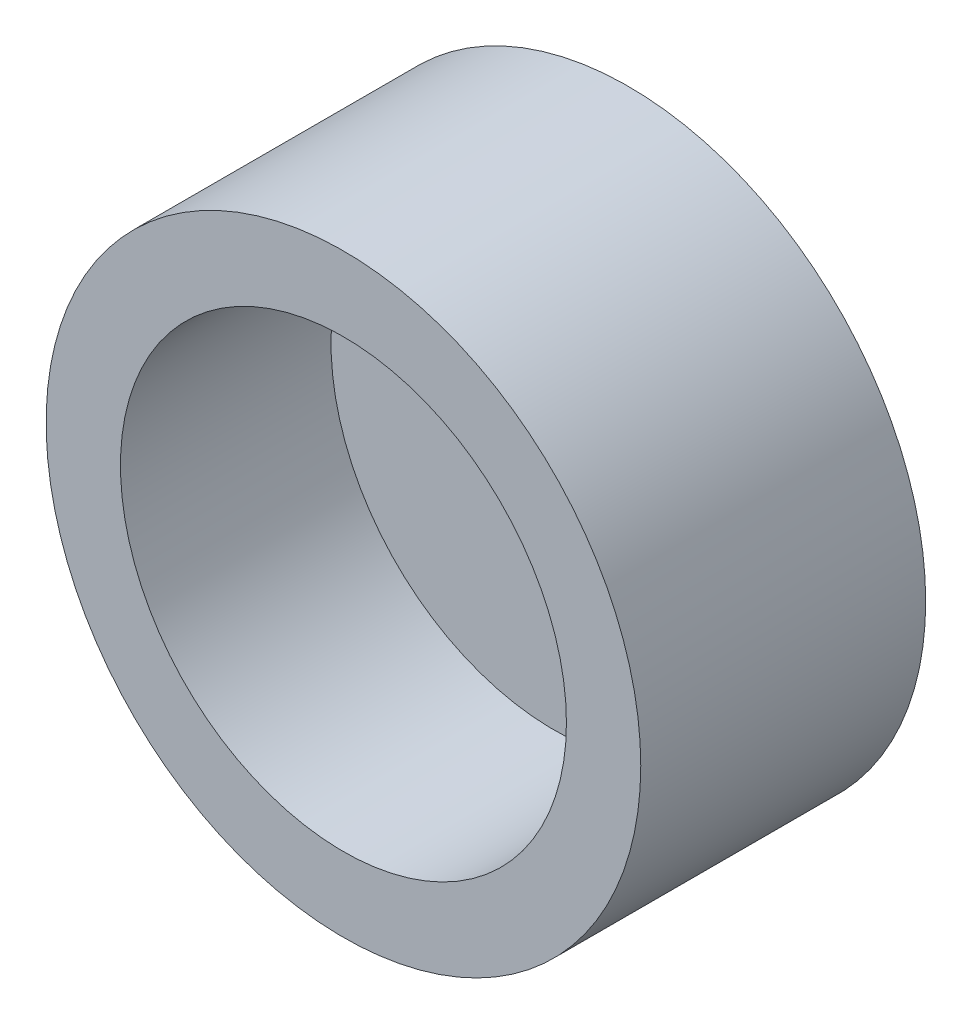
ISO-10303-21;
HEADER;
FILE_DESCRIPTION(('STEP AP214'),'2;1');
FILE_NAME('part.step','',(''),(''),'','','');
FILE_SCHEMA(('AUTOMOTIVE_DESIGN { 1 0 10303 214 1 1 1 1 }'));
ENDSEC;
DATA;
#1=APPLICATION_CONTEXT('core data for automotive mechanical design processes');
#2=APPLICATION_PROTOCOL_DEFINITION('international standard','automotive_design',2000,#1);
#3=PRODUCT_CONTEXT('',#1,'mechanical');
#4=PRODUCT('Part','Part','',(#3));
#5=PRODUCT_RELATED_PRODUCT_CATEGORY('part','',(#4));
#6=PRODUCT_DEFINITION_FORMATION('','',#4);
#7=PRODUCT_DEFINITION_CONTEXT('part definition',#1,'design');
#8=PRODUCT_DEFINITION('design','',#6,#7);
#9=PRODUCT_DEFINITION_SHAPE('','',#8);
#10=(LENGTH_UNIT() NAMED_UNIT(*) SI_UNIT(.MILLI.,.METRE.));
#11=(NAMED_UNIT(*) PLANE_ANGLE_UNIT() SI_UNIT($,.RADIAN.));
#12=(NAMED_UNIT(*) SI_UNIT($,.STERADIAN.) SOLID_ANGLE_UNIT());
#13=UNCERTAINTY_MEASURE_WITH_UNIT(LENGTH_MEASURE(1.E-05),#10,'distance_accuracy_value','');
#14=(GEOMETRIC_REPRESENTATION_CONTEXT(3) GLOBAL_UNCERTAINTY_ASSIGNED_CONTEXT((#13)) GLOBAL_UNIT_ASSIGNED_CONTEXT((#10,
#11,#12)) REPRESENTATION_CONTEXT('',''));
#15=CARTESIAN_POINT('',(0.,0.,0.));
#16=DIRECTION('',(0.,0.,1.));
#17=DIRECTION('',(1.,0.,0.));
#18=AXIS2_PLACEMENT_3D('',#15,#16,#17);
#19=CARTESIAN_POINT('',(0.,0.,8.5));
#20=DIRECTION('',(0.,0.,1.));
#21=DIRECTION('',(1.,0.,0.));
#22=AXIS2_PLACEMENT_3D('',#19,#20,#21);
#23=PLANE('',#22);
#24=CARTESIAN_POINT('',(0.,0.,8.5));
#25=DIRECTION('',(0.,0.,1.));
#26=DIRECTION('',(1.,0.,0.));
#27=AXIS2_PLACEMENT_3D('',#24,#25,#26);
#28=CIRCLE('',#27,12.);
#29=CARTESIAN_POINT('',(12.,0.,8.5));
#30=VERTEX_POINT('',#29);
#31=EDGE_CURVE('E10',#30,#30,#28,.T.);
#32=ORIENTED_EDGE('',*,*,#31,.T.);
#33=EDGE_LOOP('',(#32));
#34=FACE_BOUND('',#33,.T.);
#35=CARTESIAN_POINT('',(0.,0.,8.5));
#36=DIRECTION('',(0.,0.,1.));
#37=DIRECTION('',(1.,0.,0.));
#38=AXIS2_PLACEMENT_3D('',#35,#36,#37);
#39=CIRCLE('',#38,9.);
#40=CARTESIAN_POINT('',(9.,0.,8.5));
#41=VERTEX_POINT('',#40);
#42=EDGE_CURVE('E38',#41,#41,#39,.T.);
#43=ORIENTED_EDGE('',*,*,#42,.F.);
#44=EDGE_LOOP('',(#43));
#45=FACE_BOUND('',#44,.T.);
#46=ADVANCED_FACE('F31',(#34,#45),#23,.T.);
#47=CARTESIAN_POINT('',(0.,0.,8.5));
#48=DIRECTION('',(0.,0.,-1.));
#49=DIRECTION('',(-1.,0.,0.));
#50=AXIS2_PLACEMENT_3D('',#47,#48,#49);
#51=CYLINDRICAL_SURFACE('',#50,12.);
#52=ORIENTED_EDGE('',*,*,#31,.F.);
#53=EDGE_LOOP('',(#52));
#54=FACE_BOUND('',#53,.T.);
#55=CARTESIAN_POINT('',(0.,0.,-3.));
#56=DIRECTION('',(0.,0.,1.));
#57=DIRECTION('',(1.,0.,0.));
#58=AXIS2_PLACEMENT_3D('',#55,#56,#57);
#59=CIRCLE('',#58,12.);
#60=CARTESIAN_POINT('',(12.,0.,-3.));
#61=VERTEX_POINT('',#60);
#62=EDGE_CURVE('E47',#61,#61,#59,.T.);
#63=ORIENTED_EDGE('',*,*,#62,.T.);
#64=EDGE_LOOP('',(#63));
#65=FACE_BOUND('',#64,.T.);
#66=ADVANCED_FACE('F33',(#54,#65),#51,.T.);
#67=CARTESIAN_POINT('',(0.,0.,8.5));
#68=DIRECTION('',(0.,0.,-1.));
#69=DIRECTION('',(-1.,0.,0.));
#70=AXIS2_PLACEMENT_3D('',#67,#68,#69);
#71=CYLINDRICAL_SURFACE('',#70,9.);
#72=ORIENTED_EDGE('',*,*,#42,.T.);
#73=EDGE_LOOP('',(#72));
#74=FACE_BOUND('',#73,.T.);
#75=CARTESIAN_POINT('',(0.,0.,0.));
#76=DIRECTION('',(0.,0.,1.));
#77=DIRECTION('',(1.,0.,0.));
#78=AXIS2_PLACEMENT_3D('',#75,#76,#77);
#79=CIRCLE('',#78,9.);
#80=CARTESIAN_POINT('',(9.,0.,0.));
#81=VERTEX_POINT('',#80);
#82=EDGE_CURVE('E42',#81,#81,#79,.T.);
#83=ORIENTED_EDGE('',*,*,#82,.F.);
#84=EDGE_LOOP('',(#83));
#85=FACE_BOUND('',#84,.T.);
#86=ADVANCED_FACE('F74',(#74,#85),#71,.F.);
#87=CARTESIAN_POINT('',(0.,0.,0.));
#88=DIRECTION('',(0.,0.,1.));
#89=DIRECTION('',(1.,0.,0.));
#90=AXIS2_PLACEMENT_3D('',#87,#88,#89);
#91=PLANE('',#90);
#92=ORIENTED_EDGE('',*,*,#82,.T.);
#93=EDGE_LOOP('',(#92));
#94=FACE_BOUND('',#93,.T.);
#95=ADVANCED_FACE('F69',(#94),#91,.T.);
#96=CARTESIAN_POINT('',(0.,0.,-3.));
#97=DIRECTION('',(0.,0.,1.));
#98=DIRECTION('',(1.,0.,0.));
#99=AXIS2_PLACEMENT_3D('',#96,#97,#98);
#100=PLANE('',#99);
#101=CARTESIAN_POINT('',(0.,0.,-3.));
#102=DIRECTION('',(0.,0.,-1.));
#103=DIRECTION('',(-1.,0.,0.));
#104=AXIS2_PLACEMENT_3D('',#101,#102,#103);
#105=CIRCLE('',#104,5.);
#106=CARTESIAN_POINT('',(-5.,0.,-3.));
#107=VERTEX_POINT('',#106);
#108=EDGE_CURVE('E52',#107,#107,#105,.T.);
#109=ORIENTED_EDGE('',*,*,#108,.F.);
#110=EDGE_LOOP('',(#109));
#111=FACE_BOUND('',#110,.T.);
#112=ORIENTED_EDGE('',*,*,#62,.F.);
#113=EDGE_LOOP('',(#112));
#114=FACE_BOUND('',#113,.T.);
#115=ADVANCED_FACE('F63',(#111,#114),#100,.F.);
#116=CARTESIAN_POINT('',(0.,0.,-1.));
#117=DIRECTION('',(0.,0.,-1.));
#118=DIRECTION('',(-1.,0.,0.));
#119=AXIS2_PLACEMENT_3D('',#116,#117,#118);
#120=CYLINDRICAL_SURFACE('',#119,5.);
#121=CARTESIAN_POINT('',(0.,0.,-1.));
#122=DIRECTION('',(0.,0.,-1.));
#123=DIRECTION('',(-1.,0.,0.));
#124=AXIS2_PLACEMENT_3D('',#121,#122,#123);
#125=CIRCLE('',#124,5.);
#126=CARTESIAN_POINT('',(-5.,0.,-1.));
#127=VERTEX_POINT('',#126);
#128=EDGE_CURVE('E51',#127,#127,#125,.T.);
#129=ORIENTED_EDGE('',*,*,#128,.F.);
#130=EDGE_LOOP('',(#129));
#131=FACE_BOUND('',#130,.T.);
#132=ORIENTED_EDGE('',*,*,#108,.T.);
#133=EDGE_LOOP('',(#132));
#134=FACE_BOUND('',#133,.T.);
#135=ADVANCED_FACE('F60',(#131,#134),#120,.F.);
#136=CARTESIAN_POINT('',(0.,0.,-1.));
#137=DIRECTION('',(0.,0.,-1.));
#138=DIRECTION('',(-1.,0.,0.));
#139=AXIS2_PLACEMENT_3D('',#136,#137,#138);
#140=PLANE('',#139);
#141=ORIENTED_EDGE('',*,*,#128,.T.);
#142=EDGE_LOOP('',(#141));
#143=FACE_BOUND('',#142,.T.);
#144=ADVANCED_FACE('F58',(#143),#140,.T.);
#145=CLOSED_SHELL('',(#46,#66,#86,#95,#115,#135,#144));
#146=MANIFOLD_SOLID_BREP('B2',#145);
#147=ADVANCED_BREP_SHAPE_REPRESENTATION('',(#18,#146),#14);
#148=SHAPE_DEFINITION_REPRESENTATION(#9,#147);
ENDSEC;
END-ISO-10303-21;
